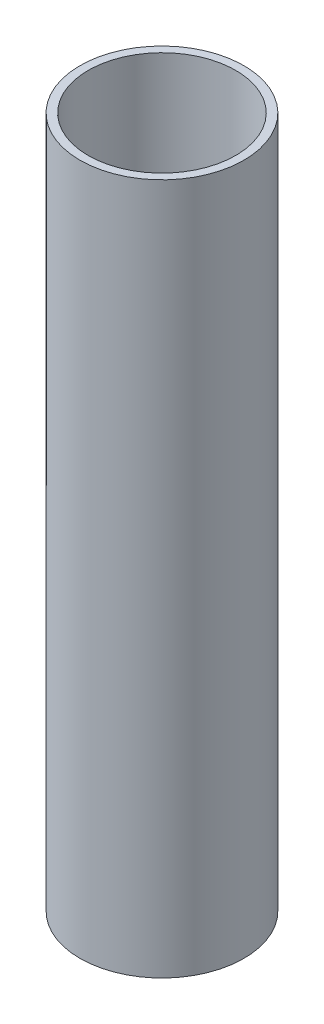
ISO-10303-21;
HEADER;
FILE_DESCRIPTION(('STEP AP214'),'2;1');
FILE_NAME('part.step','',(''),(''),'','','');
FILE_SCHEMA(('AUTOMOTIVE_DESIGN { 1 0 10303 214 1 1 1 1 }'));
ENDSEC;
DATA;
#1=APPLICATION_CONTEXT('core data for automotive mechanical design processes');
#2=APPLICATION_PROTOCOL_DEFINITION('international standard','automotive_design',2000,#1);
#3=PRODUCT_CONTEXT('',#1,'mechanical');
#4=PRODUCT('Part','Part','',(#3));
#5=PRODUCT_RELATED_PRODUCT_CATEGORY('part','',(#4));
#6=PRODUCT_DEFINITION_FORMATION('','',#4);
#7=PRODUCT_DEFINITION_CONTEXT('part definition',#1,'design');
#8=PRODUCT_DEFINITION('design','',#6,#7);
#9=PRODUCT_DEFINITION_SHAPE('','',#8);
#10=(LENGTH_UNIT() NAMED_UNIT(*) SI_UNIT(.MILLI.,.METRE.));
#11=(NAMED_UNIT(*) PLANE_ANGLE_UNIT() SI_UNIT($,.RADIAN.));
#12=(NAMED_UNIT(*) SI_UNIT($,.STERADIAN.) SOLID_ANGLE_UNIT());
#13=UNCERTAINTY_MEASURE_WITH_UNIT(LENGTH_MEASURE(1.E-05),#10,'distance_accuracy_value','');
#14=(GEOMETRIC_REPRESENTATION_CONTEXT(3) GLOBAL_UNCERTAINTY_ASSIGNED_CONTEXT((#13)) GLOBAL_UNIT_ASSIGNED_CONTEXT((#10,
#11,#12)) REPRESENTATION_CONTEXT('',''));
#15=CARTESIAN_POINT('',(0.,0.,0.));
#16=DIRECTION('',(0.,0.,1.));
#17=DIRECTION('',(1.,0.,0.));
#18=AXIS2_PLACEMENT_3D('',#15,#16,#17);
#19=CARTESIAN_POINT('',(0.,3.,0.));
#20=DIRECTION('',(0.,-1.,0.));
#21=DIRECTION('',(0.,0.,-1.));
#22=AXIS2_PLACEMENT_3D('',#19,#20,#21);
#23=CYLINDRICAL_SURFACE('',#22,30.);
#24=CARTESIAN_POINT('',(0.,0.,0.));
#25=DIRECTION('',(0.,1.,0.));
#26=DIRECTION('',(0.,0.,1.));
#27=AXIS2_PLACEMENT_3D('',#24,#25,#26);
#28=CIRCLE('',#27,30.);
#29=CARTESIAN_POINT('',(0.,0.,30.));
#30=VERTEX_POINT('',#29);
#31=EDGE_CURVE('E106',#30,#30,#28,.T.);
#32=ORIENTED_EDGE('',*,*,#31,.T.);
#33=EDGE_LOOP('',(#32));
#34=FACE_BOUND('',#33,.T.);
#35=CARTESIAN_POINT('',(0.,253.,0.));
#36=DIRECTION('',(0.,1.,0.));
#37=DIRECTION('',(0.,0.,1.));
#38=AXIS2_PLACEMENT_3D('',#35,#36,#37);
#39=CIRCLE('',#38,30.);
#40=CARTESIAN_POINT('',(0.,253.,30.));
#41=VERTEX_POINT('',#40);
#42=EDGE_CURVE('E103',#41,#41,#39,.T.);
#43=ORIENTED_EDGE('',*,*,#42,.F.);
#44=EDGE_LOOP('',(#43));
#45=FACE_BOUND('',#44,.T.);
#46=ADVANCED_FACE('F33',(#34,#45),#23,.T.);
#47=CARTESIAN_POINT('',(0.,0.,0.));
#48=DIRECTION('',(0.,1.,0.));
#49=DIRECTION('',(0.,0.,1.));
#50=AXIS2_PLACEMENT_3D('',#47,#48,#49);
#51=PLANE('',#50);
#52=DIRECTION('',(1.,0.,0.));
#53=VECTOR('',#52,1.);
#54=CARTESIAN_POINT('',(-1.5,0.,-12.25));
#55=LINE('',#54,#53);
#56=CARTESIAN_POINT('',(-1.5,0.,-12.25));
#57=VERTEX_POINT('',#56);
#58=CARTESIAN_POINT('',(1.5,0.,-12.25));
#59=VERTEX_POINT('',#58);
#60=EDGE_CURVE('E84',#57,#59,#55,.T.);
#61=ORIENTED_EDGE('',*,*,#60,.F.);
#62=DIRECTION('',(0.,0.,-1.));
#63=VECTOR('',#62,1.);
#64=CARTESIAN_POINT('',(-1.5,0.,0.));
#65=LINE('',#64,#63);
#66=CARTESIAN_POINT('',(-1.5,0.,12.25));
#67=VERTEX_POINT('',#66);
#68=EDGE_CURVE('E47',#67,#57,#65,.T.);
#69=ORIENTED_EDGE('',*,*,#68,.F.);
#70=DIRECTION('',(-1.,0.,0.));
#71=VECTOR('',#70,1.);
#72=CARTESIAN_POINT('',(-1.5,0.,12.25));
#73=LINE('',#72,#71);
#74=CARTESIAN_POINT('',(1.5,0.,12.25));
#75=VERTEX_POINT('',#74);
#76=EDGE_CURVE('E91',#75,#67,#73,.T.);
#77=ORIENTED_EDGE('',*,*,#76,.F.);
#78=DIRECTION('',(0.,0.,1.));
#79=VECTOR('',#78,1.);
#80=CARTESIAN_POINT('',(1.5,0.,0.));
#81=LINE('',#80,#79);
#82=EDGE_CURVE('E75',#59,#75,#81,.T.);
#83=ORIENTED_EDGE('',*,*,#82,.F.);
#84=EDGE_LOOP('',(#61,#69,#77,#83));
#85=FACE_BOUND('',#84,.T.);
#86=ORIENTED_EDGE('',*,*,#31,.F.);
#87=EDGE_LOOP('',(#86));
#88=FACE_BOUND('',#87,.T.);
#89=ADVANCED_FACE('F88',(#85,#88),#51,.F.);
#90=CARTESIAN_POINT('',(0.,253.,0.));
#91=DIRECTION('',(0.,1.,0.));
#92=DIRECTION('',(0.,0.,1.));
#93=AXIS2_PLACEMENT_3D('',#90,#91,#92);
#94=PLANE('',#93);
#95=ORIENTED_EDGE('',*,*,#42,.T.);
#96=EDGE_LOOP('',(#95));
#97=FACE_BOUND('',#96,.T.);
#98=CARTESIAN_POINT('',(0.,253.,0.));
#99=DIRECTION('',(0.,1.,0.));
#100=DIRECTION('',(0.,0.,1.));
#101=AXIS2_PLACEMENT_3D('',#98,#99,#100);
#102=CIRCLE('',#101,27.);
#103=CARTESIAN_POINT('',(0.,253.,27.));
#104=VERTEX_POINT('',#103);
#105=EDGE_CURVE('E98',#104,#104,#102,.T.);
#106=ORIENTED_EDGE('',*,*,#105,.F.);
#107=EDGE_LOOP('',(#106));
#108=FACE_BOUND('',#107,.T.);
#109=ADVANCED_FACE('F137',(#97,#108),#94,.T.);
#110=CARTESIAN_POINT('',(0.,253.,0.));
#111=DIRECTION('',(0.,-1.,0.));
#112=DIRECTION('',(0.,0.,-1.));
#113=AXIS2_PLACEMENT_3D('',#110,#111,#112);
#114=CYLINDRICAL_SURFACE('',#113,27.);
#115=ORIENTED_EDGE('',*,*,#105,.T.);
#116=EDGE_LOOP('',(#115));
#117=FACE_BOUND('',#116,.T.);
#118=CARTESIAN_POINT('',(0.,3.,0.));
#119=DIRECTION('',(0.,1.,0.));
#120=DIRECTION('',(0.,0.,1.));
#121=AXIS2_PLACEMENT_3D('',#118,#119,#120);
#122=CIRCLE('',#121,27.);
#123=CARTESIAN_POINT('',(0.,3.,27.));
#124=VERTEX_POINT('',#123);
#125=EDGE_CURVE('E109',#124,#124,#122,.F.);
#126=ORIENTED_EDGE('',*,*,#125,.T.);
#127=EDGE_LOOP('',(#126));
#128=FACE_BOUND('',#127,.T.);
#129=ADVANCED_FACE('F130',(#117,#128),#114,.F.);
#130=CARTESIAN_POINT('',(0.,3.,0.));
#131=DIRECTION('',(0.,1.,0.));
#132=DIRECTION('',(0.,0.,1.));
#133=AXIS2_PLACEMENT_3D('',#130,#131,#132);
#134=PLANE('',#133);
#135=DIRECTION('',(0.,0.,1.));
#136=VECTOR('',#135,1.);
#137=CARTESIAN_POINT('',(-1.5,3.,0.));
#138=LINE('',#137,#136);
#139=CARTESIAN_POINT('',(-1.5,3.,-12.25));
#140=VERTEX_POINT('',#139);
#141=CARTESIAN_POINT('',(-1.5,3.,12.25));
#142=VERTEX_POINT('',#141);
#143=EDGE_CURVE('E11',#140,#142,#138,.T.);
#144=ORIENTED_EDGE('',*,*,#143,.F.);
#145=DIRECTION('',(-1.,0.,0.));
#146=VECTOR('',#145,1.);
#147=CARTESIAN_POINT('',(0.,3.,-12.25));
#148=LINE('',#147,#146);
#149=CARTESIAN_POINT('',(1.5,3.,-12.25));
#150=VERTEX_POINT('',#149);
#151=EDGE_CURVE('E112',#150,#140,#148,.T.);
#152=ORIENTED_EDGE('',*,*,#151,.F.);
#153=DIRECTION('',(0.,0.,-1.));
#154=VECTOR('',#153,1.);
#155=CARTESIAN_POINT('',(1.5,3.,0.));
#156=LINE('',#155,#154);
#157=CARTESIAN_POINT('',(1.5,3.,12.25));
#158=VERTEX_POINT('',#157);
#159=EDGE_CURVE('E78',#158,#150,#156,.T.);
#160=ORIENTED_EDGE('',*,*,#159,.F.);
#161=DIRECTION('',(1.,0.,0.));
#162=VECTOR('',#161,1.);
#163=CARTESIAN_POINT('',(0.,3.,12.25));
#164=LINE('',#163,#162);
#165=EDGE_CURVE('E40',#142,#158,#164,.T.);
#166=ORIENTED_EDGE('',*,*,#165,.F.);
#167=EDGE_LOOP('',(#144,#152,#160,#166));
#168=FACE_BOUND('',#167,.T.);
#169=ORIENTED_EDGE('',*,*,#125,.F.);
#170=EDGE_LOOP('',(#169));
#171=FACE_BOUND('',#170,.T.);
#172=ADVANCED_FACE('F120',(#168,#171),#134,.T.);
#173=CARTESIAN_POINT('',(-1.5,44.,0.));
#174=DIRECTION('',(-1.,0.,0.));
#175=DIRECTION('',(0.,0.,1.));
#176=AXIS2_PLACEMENT_3D('',#173,#174,#175);
#177=PLANE('',#176);
#178=ORIENTED_EDGE('',*,*,#143,.T.);
#179=DIRECTION('',(0.,-1.,0.));
#180=VECTOR('',#179,1.);
#181=CARTESIAN_POINT('',(-1.5,44.,12.25));
#182=LINE('',#181,#180);
#183=EDGE_CURVE('E96',#142,#67,#182,.T.);
#184=ORIENTED_EDGE('',*,*,#183,.T.);
#185=ORIENTED_EDGE('',*,*,#68,.T.);
#186=DIRECTION('',(0.,-1.,0.));
#187=VECTOR('',#186,1.);
#188=CARTESIAN_POINT('',(-1.5,44.,-12.25));
#189=LINE('',#188,#187);
#190=EDGE_CURVE('E81',#140,#57,#189,.T.);
#191=ORIENTED_EDGE('',*,*,#190,.F.);
#192=EDGE_LOOP('',(#178,#184,#185,#191));
#193=FACE_BOUND('',#192,.T.);
#194=ADVANCED_FACE('F122',(#193),#177,.F.);
#195=CARTESIAN_POINT('',(-1.5,44.,12.25));
#196=DIRECTION('',(0.,0.,1.));
#197=DIRECTION('',(1.,0.,0.));
#198=AXIS2_PLACEMENT_3D('',#195,#196,#197);
#199=PLANE('',#198);
#200=ORIENTED_EDGE('',*,*,#165,.T.);
#201=DIRECTION('',(0.,-1.,0.));
#202=VECTOR('',#201,1.);
#203=CARTESIAN_POINT('',(1.5,44.,12.25));
#204=LINE('',#203,#202);
#205=EDGE_CURVE('E80',#158,#75,#204,.T.);
#206=ORIENTED_EDGE('',*,*,#205,.T.);
#207=ORIENTED_EDGE('',*,*,#76,.T.);
#208=ORIENTED_EDGE('',*,*,#183,.F.);
#209=EDGE_LOOP('',(#200,#206,#207,#208));
#210=FACE_BOUND('',#209,.T.);
#211=ADVANCED_FACE('F117',(#210),#199,.F.);
#212=CARTESIAN_POINT('',(1.5,44.,0.));
#213=DIRECTION('',(1.,0.,0.));
#214=DIRECTION('',(0.,0.,-1.));
#215=AXIS2_PLACEMENT_3D('',#212,#213,#214);
#216=PLANE('',#215);
#217=ORIENTED_EDGE('',*,*,#159,.T.);
#218=DIRECTION('',(0.,-1.,0.));
#219=VECTOR('',#218,1.);
#220=CARTESIAN_POINT('',(1.5,44.,-12.25));
#221=LINE('',#220,#219);
#222=EDGE_CURVE('E55',#150,#59,#221,.T.);
#223=ORIENTED_EDGE('',*,*,#222,.T.);
#224=ORIENTED_EDGE('',*,*,#82,.T.);
#225=ORIENTED_EDGE('',*,*,#205,.F.);
#226=EDGE_LOOP('',(#217,#223,#224,#225));
#227=FACE_BOUND('',#226,.T.);
#228=ADVANCED_FACE('F72',(#227),#216,.F.);
#229=CARTESIAN_POINT('',(-1.5,44.,-12.25));
#230=DIRECTION('',(0.,0.,-1.));
#231=DIRECTION('',(-1.,0.,0.));
#232=AXIS2_PLACEMENT_3D('',#229,#230,#231);
#233=PLANE('',#232);
#234=ORIENTED_EDGE('',*,*,#151,.T.);
#235=ORIENTED_EDGE('',*,*,#190,.T.);
#236=ORIENTED_EDGE('',*,*,#60,.T.);
#237=ORIENTED_EDGE('',*,*,#222,.F.);
#238=EDGE_LOOP('',(#234,#235,#236,#237));
#239=FACE_BOUND('',#238,.T.);
#240=ADVANCED_FACE('F85',(#239),#233,.F.);
#241=CLOSED_SHELL('',(#46,#89,#109,#129,#172,#194,#211,#228,#240));
#242=MANIFOLD_SOLID_BREP('B2',#241);
#243=ADVANCED_BREP_SHAPE_REPRESENTATION('',(#18,#242),#14);
#244=SHAPE_DEFINITION_REPRESENTATION(#9,#243);
ENDSEC;
END-ISO-10303-21;
